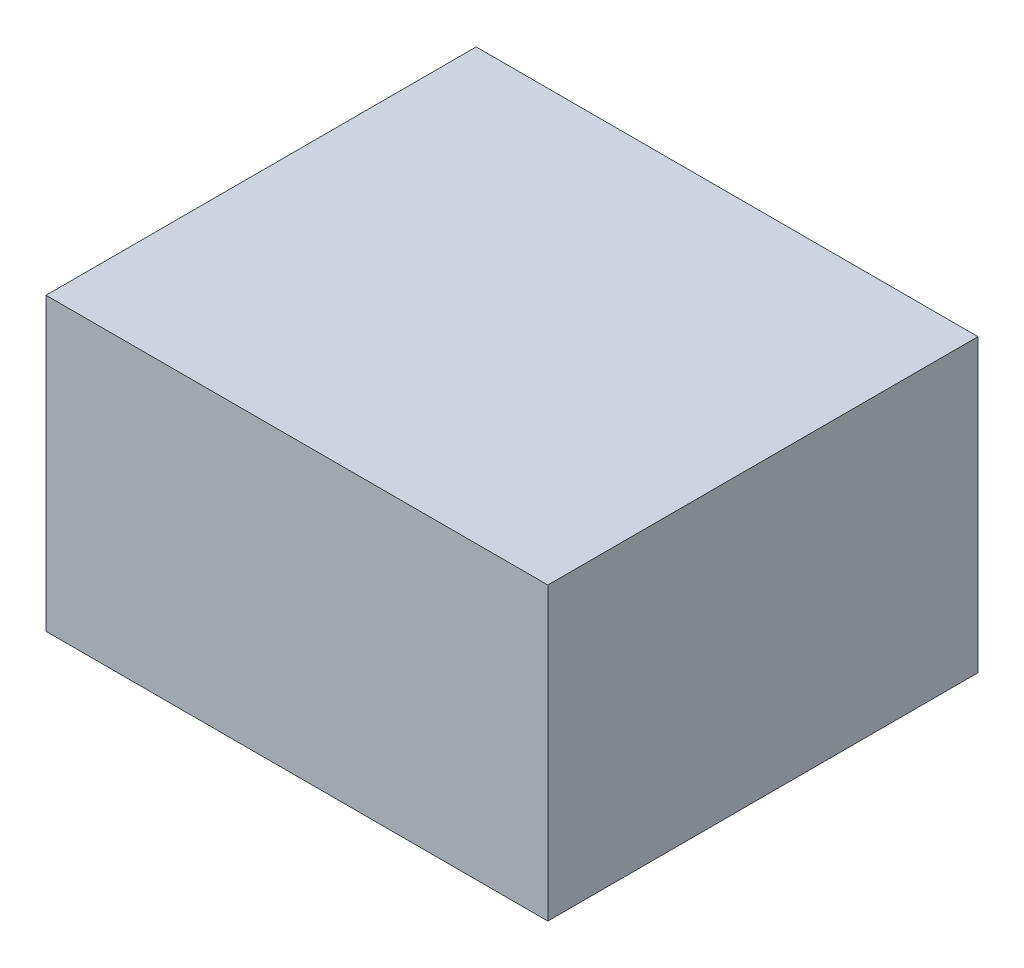
ISO-10303-21;
HEADER;
FILE_DESCRIPTION(('STEP AP214'),'2;1');
FILE_NAME('part.step','',(''),(''),'','','');
FILE_SCHEMA(('AUTOMOTIVE_DESIGN { 1 0 10303 214 1 1 1 1 }'));
ENDSEC;
DATA;
#1=APPLICATION_CONTEXT('core data for automotive mechanical design processes');
#2=APPLICATION_PROTOCOL_DEFINITION('international standard','automotive_design',2000,#1);
#3=PRODUCT_CONTEXT('',#1,'mechanical');
#4=PRODUCT('Part','Part','',(#3));
#5=PRODUCT_RELATED_PRODUCT_CATEGORY('part','',(#4));
#6=PRODUCT_DEFINITION_FORMATION('','',#4);
#7=PRODUCT_DEFINITION_CONTEXT('part definition',#1,'design');
#8=PRODUCT_DEFINITION('design','',#6,#7);
#9=PRODUCT_DEFINITION_SHAPE('','',#8);
#10=(LENGTH_UNIT() NAMED_UNIT(*) SI_UNIT(.MILLI.,.METRE.));
#11=(NAMED_UNIT(*) PLANE_ANGLE_UNIT() SI_UNIT($,.RADIAN.));
#12=(NAMED_UNIT(*) SI_UNIT($,.STERADIAN.) SOLID_ANGLE_UNIT());
#13=UNCERTAINTY_MEASURE_WITH_UNIT(LENGTH_MEASURE(1.E-05),#10,'distance_accuracy_value','');
#14=(GEOMETRIC_REPRESENTATION_CONTEXT(3) GLOBAL_UNCERTAINTY_ASSIGNED_CONTEXT((#13)) GLOBAL_UNIT_ASSIGNED_CONTEXT((#10,
#11,#12)) REPRESENTATION_CONTEXT('',''));
#15=CARTESIAN_POINT('',(0.,0.,0.));
#16=DIRECTION('',(0.,0.,1.));
#17=DIRECTION('',(1.,0.,0.));
#18=AXIS2_PLACEMENT_3D('',#15,#16,#17);
#19=CARTESIAN_POINT('',(-0.79999999999999,0.475,1.025));
#20=DIRECTION('',(0.,0.,-1.));
#21=DIRECTION('',(-1.,0.,0.));
#22=AXIS2_PLACEMENT_3D('',#19,#20,#21);
#23=PLANE('',#22);
#24=DIRECTION('',(1.,0.,0.));
#25=VECTOR('',#24,1.);
#26=CARTESIAN_POINT('',(-0.79999999999999,0.272,1.025));
#27=LINE('',#26,#25);
#28=CARTESIAN_POINT('',(-0.79999999999999,0.272,1.025));
#29=VERTEX_POINT('',#28);
#30=CARTESIAN_POINT('',(-0.449999999999989,0.272,1.025));
#31=VERTEX_POINT('',#30);
#32=EDGE_CURVE('E11',#29,#31,#27,.T.);
#33=ORIENTED_EDGE('',*,*,#32,.T.);
#34=DIRECTION('',(0.,-1.,0.));
#35=VECTOR('',#34,1.);
#36=CARTESIAN_POINT('',(-0.449999999999989,0.475,1.025));
#37=LINE('',#36,#35);
#38=CARTESIAN_POINT('',(-0.449999999999989,0.475,1.025));
#39=VERTEX_POINT('',#38);
#40=EDGE_CURVE('E24',#39,#31,#37,.T.);
#41=ORIENTED_EDGE('',*,*,#40,.F.);
#42=DIRECTION('',(1.,0.,0.));
#43=VECTOR('',#42,1.);
#44=CARTESIAN_POINT('',(-0.79999999999999,0.475,1.025));
#45=LINE('',#44,#43);
#46=CARTESIAN_POINT('',(-0.79999999999999,0.475,1.025));
#47=VERTEX_POINT('',#46);
#48=EDGE_CURVE('E88',#47,#39,#45,.T.);
#49=ORIENTED_EDGE('',*,*,#48,.F.);
#50=DIRECTION('',(0.,-1.,0.));
#51=VECTOR('',#50,1.);
#52=CARTESIAN_POINT('',(-0.79999999999999,0.475,1.025));
#53=LINE('',#52,#51);
#54=EDGE_CURVE('E77',#47,#29,#53,.T.);
#55=ORIENTED_EDGE('',*,*,#54,.T.);
#56=EDGE_LOOP('',(#33,#41,#49,#55));
#57=FACE_BOUND('',#56,.T.);
#58=ADVANCED_FACE('F17',(#57),#23,.F.);
#59=CARTESIAN_POINT('',(-0.449999999999989,0.475,1.025));
#60=DIRECTION('',(-1.,0.,0.));
#61=DIRECTION('',(0.,0.,1.));
#62=AXIS2_PLACEMENT_3D('',#59,#60,#61);
#63=PLANE('',#62);
#64=DIRECTION('',(0.,0.,-1.));
#65=VECTOR('',#64,1.);
#66=CARTESIAN_POINT('',(-0.449999999999989,0.272,1.025));
#67=LINE('',#66,#65);
#68=CARTESIAN_POINT('',(-0.44999999999997,0.272,0.724999999999992));
#69=VERTEX_POINT('',#68);
#70=EDGE_CURVE('E85',#31,#69,#67,.T.);
#71=ORIENTED_EDGE('',*,*,#70,.T.);
#72=DIRECTION('',(0.,-1.,0.));
#73=VECTOR('',#72,1.);
#74=CARTESIAN_POINT('',(-0.44999999999997,0.475,0.724999999999992));
#75=LINE('',#74,#73);
#76=CARTESIAN_POINT('',(-0.44999999999997,0.475,0.724999999999992));
#77=VERTEX_POINT('',#76);
#78=EDGE_CURVE('E83',#77,#69,#75,.T.);
#79=ORIENTED_EDGE('',*,*,#78,.F.);
#80=DIRECTION('',(0.,0.,-1.));
#81=VECTOR('',#80,1.);
#82=CARTESIAN_POINT('',(-0.449999999999989,0.475,1.025));
#83=LINE('',#82,#81);
#84=EDGE_CURVE('E72',#39,#77,#83,.T.);
#85=ORIENTED_EDGE('',*,*,#84,.F.);
#86=ORIENTED_EDGE('',*,*,#40,.T.);
#87=EDGE_LOOP('',(#71,#79,#85,#86));
#88=FACE_BOUND('',#87,.T.);
#89=ADVANCED_FACE('F90',(#88),#63,.F.);
#90=CARTESIAN_POINT('',(-0.44999999999997,0.475,0.724999999999992));
#91=DIRECTION('',(0.,0.,1.));
#92=DIRECTION('',(1.,0.,0.));
#93=AXIS2_PLACEMENT_3D('',#90,#91,#92);
#94=PLANE('',#93);
#95=DIRECTION('',(-1.,0.,0.));
#96=VECTOR('',#95,1.);
#97=CARTESIAN_POINT('',(-0.44999999999997,0.272,0.724999999999992));
#98=LINE('',#97,#96);
#99=CARTESIAN_POINT('',(-0.799999999999971,0.272,0.724999999999977));
#100=VERTEX_POINT('',#99);
#101=EDGE_CURVE('E60',#69,#100,#98,.T.);
#102=ORIENTED_EDGE('',*,*,#101,.T.);
#103=DIRECTION('',(0.,-1.,0.));
#104=VECTOR('',#103,1.);
#105=CARTESIAN_POINT('',(-0.799999999999971,0.475,0.724999999999977));
#106=LINE('',#105,#104);
#107=CARTESIAN_POINT('',(-0.799999999999971,0.475,0.724999999999977));
#108=VERTEX_POINT('',#107);
#109=EDGE_CURVE('E54',#108,#100,#106,.T.);
#110=ORIENTED_EDGE('',*,*,#109,.F.);
#111=DIRECTION('',(-1.,0.,0.));
#112=VECTOR('',#111,1.);
#113=CARTESIAN_POINT('',(-0.44999999999997,0.475,0.724999999999992));
#114=LINE('',#113,#112);
#115=EDGE_CURVE('E58',#77,#108,#114,.T.);
#116=ORIENTED_EDGE('',*,*,#115,.F.);
#117=ORIENTED_EDGE('',*,*,#78,.T.);
#118=EDGE_LOOP('',(#102,#110,#116,#117));
#119=FACE_BOUND('',#118,.T.);
#120=ADVANCED_FACE('F56',(#119),#94,.F.);
#121=CARTESIAN_POINT('',(-0.799999999999971,0.475,0.724999999999977));
#122=DIRECTION('',(1.,0.,0.));
#123=DIRECTION('',(0.,0.,-1.));
#124=AXIS2_PLACEMENT_3D('',#121,#122,#123);
#125=PLANE('',#124);
#126=DIRECTION('',(0.,0.,1.));
#127=VECTOR('',#126,1.);
#128=CARTESIAN_POINT('',(-0.799999999999971,0.272,0.724999999999977));
#129=LINE('',#128,#127);
#130=EDGE_CURVE('E73',#100,#29,#129,.T.);
#131=ORIENTED_EDGE('',*,*,#130,.T.);
#132=ORIENTED_EDGE('',*,*,#54,.F.);
#133=DIRECTION('',(0.,0.,1.));
#134=VECTOR('',#133,1.);
#135=CARTESIAN_POINT('',(-0.799999999999971,0.475,0.724999999999977));
#136=LINE('',#135,#134);
#137=EDGE_CURVE('E70',#108,#47,#136,.T.);
#138=ORIENTED_EDGE('',*,*,#137,.F.);
#139=ORIENTED_EDGE('',*,*,#109,.T.);
#140=EDGE_LOOP('',(#131,#132,#138,#139));
#141=FACE_BOUND('',#140,.T.);
#142=ADVANCED_FACE('F76',(#141),#125,.F.);
#143=CARTESIAN_POINT('',(0.,0.475,0.));
#144=DIRECTION('',(0.,1.,0.));
#145=DIRECTION('',(0.,0.,1.));
#146=AXIS2_PLACEMENT_3D('',#143,#144,#145);
#147=PLANE('',#146);
#148=ORIENTED_EDGE('',*,*,#48,.T.);
#149=ORIENTED_EDGE('',*,*,#84,.T.);
#150=ORIENTED_EDGE('',*,*,#115,.T.);
#151=ORIENTED_EDGE('',*,*,#137,.T.);
#152=EDGE_LOOP('',(#148,#149,#150,#151));
#153=FACE_BOUND('',#152,.T.);
#154=ADVANCED_FACE('F69',(#153),#147,.T.);
#155=CARTESIAN_POINT('',(0.,0.272,0.));
#156=DIRECTION('',(0.,1.,0.));
#157=DIRECTION('',(0.,0.,1.));
#158=AXIS2_PLACEMENT_3D('',#155,#156,#157);
#159=PLANE('',#158);
#160=ORIENTED_EDGE('',*,*,#32,.F.);
#161=ORIENTED_EDGE('',*,*,#130,.F.);
#162=ORIENTED_EDGE('',*,*,#101,.F.);
#163=ORIENTED_EDGE('',*,*,#70,.F.);
#164=EDGE_LOOP('',(#160,#161,#162,#163));
#165=FACE_BOUND('',#164,.T.);
#166=ADVANCED_FACE('F91',(#165),#159,.F.);
#167=CLOSED_SHELL('',(#58,#89,#120,#142,#154,#166));
#168=MANIFOLD_SOLID_BREP('B1',#167);
#169=ADVANCED_BREP_SHAPE_REPRESENTATION('',(#18,#168),#14);
#170=SHAPE_DEFINITION_REPRESENTATION(#9,#169);
ENDSEC;
END-ISO-10303-21;
